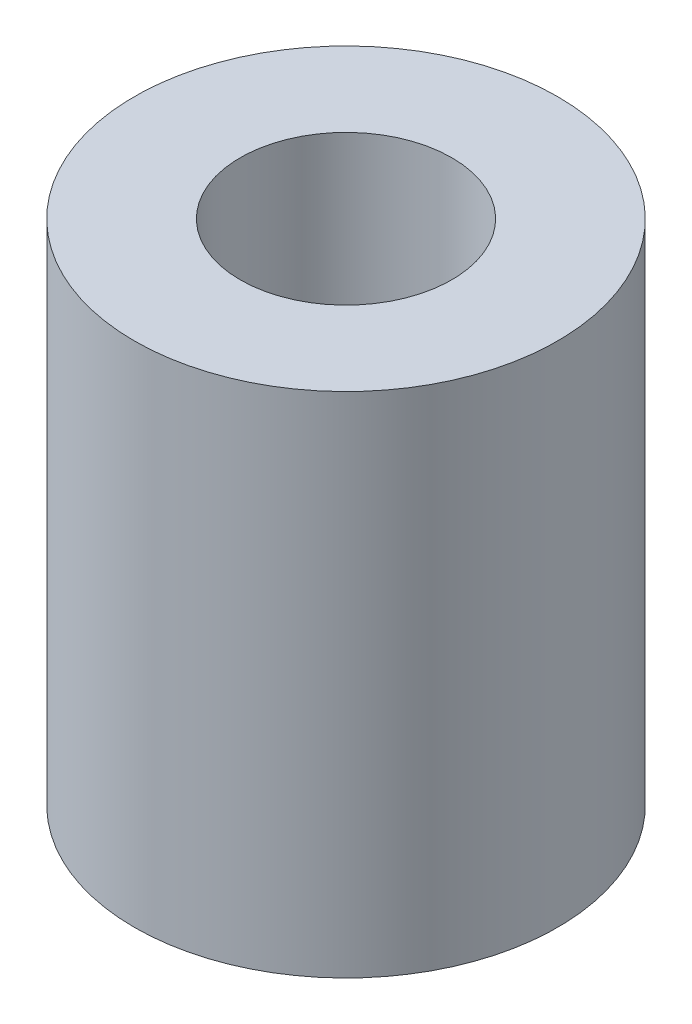
ISO-10303-21;
HEADER;
FILE_DESCRIPTION(('STEP AP214'),'2;1');
FILE_NAME('part.step','',(''),(''),'','','');
FILE_SCHEMA(('AUTOMOTIVE_DESIGN { 1 0 10303 214 1 1 1 1 }'));
ENDSEC;
DATA;
#1=APPLICATION_CONTEXT('core data for automotive mechanical design processes');
#2=APPLICATION_PROTOCOL_DEFINITION('international standard','automotive_design',2000,#1);
#3=PRODUCT_CONTEXT('',#1,'mechanical');
#4=PRODUCT('Part','Part','',(#3));
#5=PRODUCT_RELATED_PRODUCT_CATEGORY('part','',(#4));
#6=PRODUCT_DEFINITION_FORMATION('','',#4);
#7=PRODUCT_DEFINITION_CONTEXT('part definition',#1,'design');
#8=PRODUCT_DEFINITION('design','',#6,#7);
#9=PRODUCT_DEFINITION_SHAPE('','',#8);
#10=(LENGTH_UNIT() NAMED_UNIT(*) SI_UNIT(.MILLI.,.METRE.));
#11=(NAMED_UNIT(*) PLANE_ANGLE_UNIT() SI_UNIT($,.RADIAN.));
#12=(NAMED_UNIT(*) SI_UNIT($,.STERADIAN.) SOLID_ANGLE_UNIT());
#13=UNCERTAINTY_MEASURE_WITH_UNIT(LENGTH_MEASURE(1.E-05),#10,'distance_accuracy_value','');
#14=(GEOMETRIC_REPRESENTATION_CONTEXT(3) GLOBAL_UNCERTAINTY_ASSIGNED_CONTEXT((#13)) GLOBAL_UNIT_ASSIGNED_CONTEXT((#10,
#11,#12)) REPRESENTATION_CONTEXT('',''));
#15=CARTESIAN_POINT('',(0.,0.,0.));
#16=DIRECTION('',(0.,0.,1.));
#17=DIRECTION('',(1.,0.,0.));
#18=AXIS2_PLACEMENT_3D('',#15,#16,#17);
#19=CARTESIAN_POINT('',(0.,4.8,0.));
#20=DIRECTION('',(0.,1.,0.));
#21=DIRECTION('',(0.,0.,1.));
#22=AXIS2_PLACEMENT_3D('',#19,#20,#21);
#23=PLANE('',#22);
#24=CARTESIAN_POINT('',(0.,4.8,0.));
#25=DIRECTION('',(0.,1.,0.));
#26=DIRECTION('',(0.,0.,1.));
#27=AXIS2_PLACEMENT_3D('',#24,#25,#26);
#28=CIRCLE('',#27,2.);
#29=CARTESIAN_POINT('',(0.,4.8,2.));
#30=VERTEX_POINT('',#29);
#31=EDGE_CURVE('E10',#30,#30,#28,.T.);
#32=ORIENTED_EDGE('',*,*,#31,.T.);
#33=EDGE_LOOP('',(#32));
#34=FACE_BOUND('',#33,.T.);
#35=CARTESIAN_POINT('',(0.,4.8,0.));
#36=DIRECTION('',(0.,1.,0.));
#37=DIRECTION('',(0.,0.,1.));
#38=AXIS2_PLACEMENT_3D('',#35,#36,#37);
#39=CIRCLE('',#38,1.);
#40=CARTESIAN_POINT('',(0.,4.8,1.));
#41=VERTEX_POINT('',#40);
#42=EDGE_CURVE('E50',#41,#41,#39,.T.);
#43=ORIENTED_EDGE('',*,*,#42,.F.);
#44=EDGE_LOOP('',(#43));
#45=FACE_BOUND('',#44,.T.);
#46=ADVANCED_FACE('F37',(#34,#45),#23,.T.);
#47=CARTESIAN_POINT('',(0.,0.,0.));
#48=DIRECTION('',(0.,1.,0.));
#49=DIRECTION('',(0.,0.,1.));
#50=AXIS2_PLACEMENT_3D('',#47,#48,#49);
#51=PLANE('',#50);
#52=CARTESIAN_POINT('',(0.,0.,0.));
#53=DIRECTION('',(0.,1.,0.));
#54=DIRECTION('',(0.,0.,1.));
#55=AXIS2_PLACEMENT_3D('',#52,#53,#54);
#56=CIRCLE('',#55,2.);
#57=CARTESIAN_POINT('',(0.,0.,2.));
#58=VERTEX_POINT('',#57);
#59=EDGE_CURVE('E41',#58,#58,#56,.T.);
#60=ORIENTED_EDGE('',*,*,#59,.F.);
#61=EDGE_LOOP('',(#60));
#62=FACE_BOUND('',#61,.T.);
#63=CARTESIAN_POINT('',(0.,0.,0.));
#64=DIRECTION('',(0.,1.,0.));
#65=DIRECTION('',(0.,0.,1.));
#66=AXIS2_PLACEMENT_3D('',#63,#64,#65);
#67=CIRCLE('',#66,1.);
#68=CARTESIAN_POINT('',(0.,0.,1.));
#69=VERTEX_POINT('',#68);
#70=EDGE_CURVE('E52',#69,#69,#67,.T.);
#71=ORIENTED_EDGE('',*,*,#70,.T.);
#72=EDGE_LOOP('',(#71));
#73=FACE_BOUND('',#72,.T.);
#74=ADVANCED_FACE('F64',(#62,#73),#51,.F.);
#75=CARTESIAN_POINT('',(0.,4.8,0.));
#76=DIRECTION('',(0.,-1.,0.));
#77=DIRECTION('',(0.,0.,-1.));
#78=AXIS2_PLACEMENT_3D('',#75,#76,#77);
#79=CYLINDRICAL_SURFACE('',#78,2.);
#80=ORIENTED_EDGE('',*,*,#31,.F.);
#81=EDGE_LOOP('',(#80));
#82=FACE_BOUND('',#81,.T.);
#83=ORIENTED_EDGE('',*,*,#59,.T.);
#84=EDGE_LOOP('',(#83));
#85=FACE_BOUND('',#84,.T.);
#86=ADVANCED_FACE('F39',(#82,#85),#79,.T.);
#87=CARTESIAN_POINT('',(0.,4.8,0.));
#88=DIRECTION('',(0.,-1.,0.));
#89=DIRECTION('',(0.,0.,-1.));
#90=AXIS2_PLACEMENT_3D('',#87,#88,#89);
#91=CYLINDRICAL_SURFACE('',#90,1.);
#92=ORIENTED_EDGE('',*,*,#42,.T.);
#93=EDGE_LOOP('',(#92));
#94=FACE_BOUND('',#93,.T.);
#95=ORIENTED_EDGE('',*,*,#70,.F.);
#96=EDGE_LOOP('',(#95));
#97=FACE_BOUND('',#96,.T.);
#98=ADVANCED_FACE('F60',(#94,#97),#91,.F.);
#99=CLOSED_SHELL('',(#46,#74,#86,#98));
#100=MANIFOLD_SOLID_BREP('B2',#99);
#101=ADVANCED_BREP_SHAPE_REPRESENTATION('',(#18,#100),#14);
#102=SHAPE_DEFINITION_REPRESENTATION(#9,#101);
ENDSEC;
END-ISO-10303-21;
